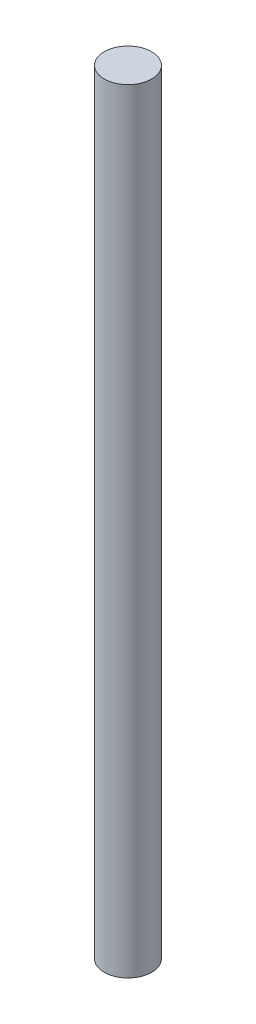
ISO-10303-21;
HEADER;
FILE_DESCRIPTION(('STEP AP214'),'2;1');
FILE_NAME('part.step','',(''),(''),'','','');
FILE_SCHEMA(('AUTOMOTIVE_DESIGN { 1 0 10303 214 1 1 1 1 }'));
ENDSEC;
DATA;
#1=APPLICATION_CONTEXT('core data for automotive mechanical design processes');
#2=APPLICATION_PROTOCOL_DEFINITION('international standard','automotive_design',2000,#1);
#3=PRODUCT_CONTEXT('',#1,'mechanical');
#4=PRODUCT('Part','Part','',(#3));
#5=PRODUCT_RELATED_PRODUCT_CATEGORY('part','',(#4));
#6=PRODUCT_DEFINITION_FORMATION('','',#4);
#7=PRODUCT_DEFINITION_CONTEXT('part definition',#1,'design');
#8=PRODUCT_DEFINITION('design','',#6,#7);
#9=PRODUCT_DEFINITION_SHAPE('','',#8);
#10=(LENGTH_UNIT() NAMED_UNIT(*) SI_UNIT(.MILLI.,.METRE.));
#11=(NAMED_UNIT(*) PLANE_ANGLE_UNIT() SI_UNIT($,.RADIAN.));
#12=(NAMED_UNIT(*) SI_UNIT($,.STERADIAN.) SOLID_ANGLE_UNIT());
#13=UNCERTAINTY_MEASURE_WITH_UNIT(LENGTH_MEASURE(1.E-05),#10,'distance_accuracy_value','');
#14=(GEOMETRIC_REPRESENTATION_CONTEXT(3) GLOBAL_UNCERTAINTY_ASSIGNED_CONTEXT((#13)) GLOBAL_UNIT_ASSIGNED_CONTEXT((#10,
#11,#12)) REPRESENTATION_CONTEXT('',''));
#15=CARTESIAN_POINT('',(0.,0.,0.));
#16=DIRECTION('',(0.,0.,1.));
#17=DIRECTION('',(1.,0.,0.));
#18=AXIS2_PLACEMENT_3D('',#15,#16,#17);
#19=CARTESIAN_POINT('',(0.,14.7,0.));
#20=DIRECTION('',(0.,-1.,0.));
#21=DIRECTION('',(0.,0.,-1.));
#22=AXIS2_PLACEMENT_3D('',#19,#20,#21);
#23=CYLINDRICAL_SURFACE('',#22,0.9);
#24=CARTESIAN_POINT('',(0.,14.7,0.));
#25=DIRECTION('',(0.,1.,0.));
#26=DIRECTION('',(0.,0.,1.));
#27=AXIS2_PLACEMENT_3D('',#24,#25,#26);
#28=CIRCLE('',#27,0.9);
#29=CARTESIAN_POINT('',(0.,14.7,0.9));
#30=VERTEX_POINT('',#29);
#31=EDGE_CURVE('E10',#30,#30,#28,.T.);
#32=ORIENTED_EDGE('',*,*,#31,.F.);
#33=EDGE_LOOP('',(#32));
#34=FACE_BOUND('',#33,.T.);
#35=CARTESIAN_POINT('',(0.,-14.7,0.));
#36=DIRECTION('',(0.,1.,0.));
#37=DIRECTION('',(0.,0.,1.));
#38=AXIS2_PLACEMENT_3D('',#35,#36,#37);
#39=CIRCLE('',#38,0.9);
#40=CARTESIAN_POINT('',(0.,-14.7,0.9));
#41=VERTEX_POINT('',#40);
#42=EDGE_CURVE('E35',#41,#41,#39,.T.);
#43=ORIENTED_EDGE('',*,*,#42,.T.);
#44=EDGE_LOOP('',(#43));
#45=FACE_BOUND('',#44,.T.);
#46=ADVANCED_FACE('F32',(#34,#45),#23,.T.);
#47=CARTESIAN_POINT('',(0.,14.7,0.));
#48=DIRECTION('',(0.,1.,0.));
#49=DIRECTION('',(0.,0.,1.));
#50=AXIS2_PLACEMENT_3D('',#47,#48,#49);
#51=PLANE('',#50);
#52=ORIENTED_EDGE('',*,*,#31,.T.);
#53=EDGE_LOOP('',(#52));
#54=FACE_BOUND('',#53,.T.);
#55=ADVANCED_FACE('F47',(#54),#51,.T.);
#56=CARTESIAN_POINT('',(0.,-14.7,0.));
#57=DIRECTION('',(0.,1.,0.));
#58=DIRECTION('',(0.,0.,1.));
#59=AXIS2_PLACEMENT_3D('',#56,#57,#58);
#60=PLANE('',#59);
#61=ORIENTED_EDGE('',*,*,#42,.F.);
#62=EDGE_LOOP('',(#61));
#63=FACE_BOUND('',#62,.T.);
#64=ADVANCED_FACE('F45',(#63),#60,.F.);
#65=CLOSED_SHELL('',(#46,#55,#64));
#66=MANIFOLD_SOLID_BREP('B2',#65);
#67=ADVANCED_BREP_SHAPE_REPRESENTATION('',(#18,#66),#14);
#68=SHAPE_DEFINITION_REPRESENTATION(#9,#67);
ENDSEC;
END-ISO-10303-21;
